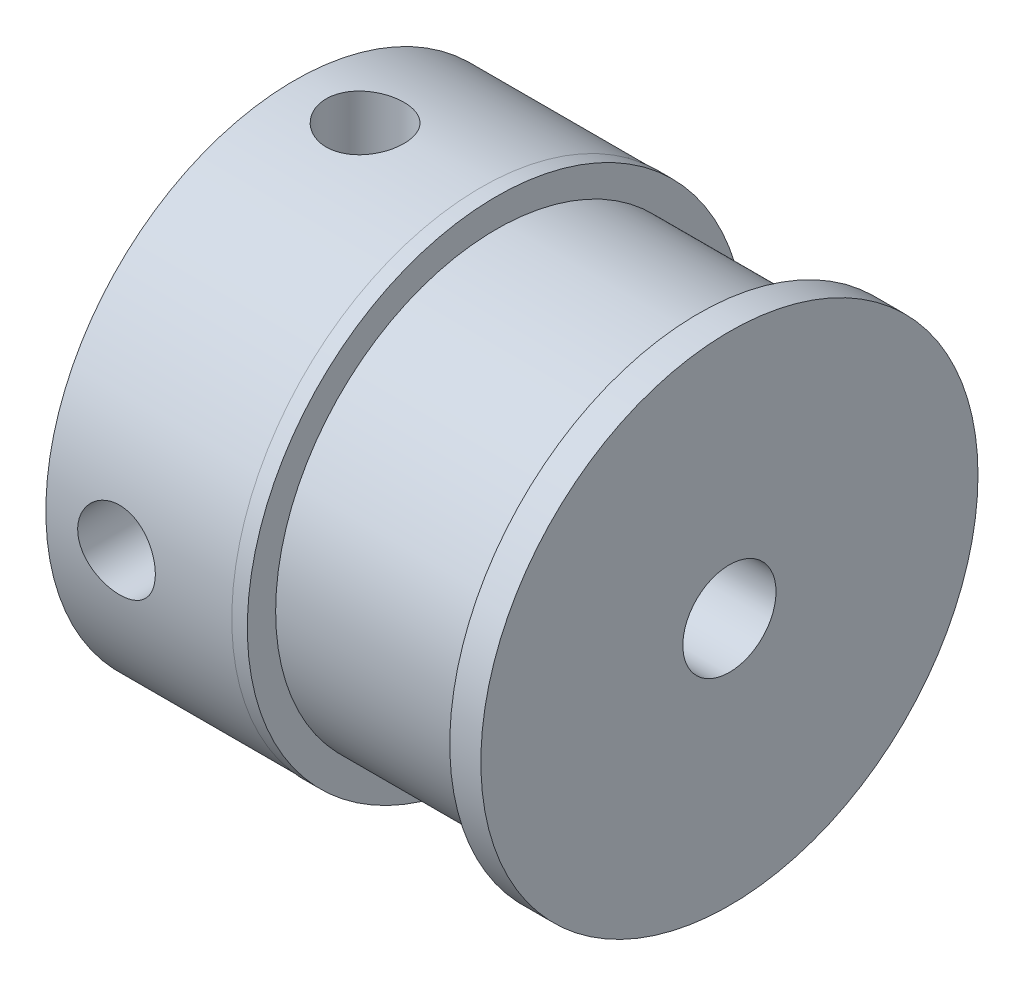
ISO-10303-21;
HEADER;
FILE_DESCRIPTION(('STEP AP214'),'2;1');
FILE_NAME('part.step','',(''),(''),'','','');
FILE_SCHEMA(('AUTOMOTIVE_DESIGN { 1 0 10303 214 1 1 1 1 }'));
ENDSEC;
DATA;
#1=APPLICATION_CONTEXT('core data for automotive mechanical design processes');
#2=APPLICATION_PROTOCOL_DEFINITION('international standard','automotive_design',2000,#1);
#3=PRODUCT_CONTEXT('',#1,'mechanical');
#4=PRODUCT('Part','Part','',(#3));
#5=PRODUCT_RELATED_PRODUCT_CATEGORY('part','',(#4));
#6=PRODUCT_DEFINITION_FORMATION('','',#4);
#7=PRODUCT_DEFINITION_CONTEXT('part definition',#1,'design');
#8=PRODUCT_DEFINITION('design','',#6,#7);
#9=PRODUCT_DEFINITION_SHAPE('','',#8);
#10=(LENGTH_UNIT() NAMED_UNIT(*) SI_UNIT(.MILLI.,.METRE.));
#11=(NAMED_UNIT(*) PLANE_ANGLE_UNIT() SI_UNIT($,.RADIAN.));
#12=(NAMED_UNIT(*) SI_UNIT($,.STERADIAN.) SOLID_ANGLE_UNIT());
#13=UNCERTAINTY_MEASURE_WITH_UNIT(LENGTH_MEASURE(1.E-05),#10,'distance_accuracy_value','');
#14=(GEOMETRIC_REPRESENTATION_CONTEXT(3) GLOBAL_UNCERTAINTY_ASSIGNED_CONTEXT((#13)) GLOBAL_UNIT_ASSIGNED_CONTEXT((#10,
#11,#12)) REPRESENTATION_CONTEXT('',''));
#15=CARTESIAN_POINT('',(0.,0.,0.));
#16=DIRECTION('',(0.,0.,1.));
#17=DIRECTION('',(1.,0.,0.));
#18=AXIS2_PLACEMENT_3D('',#15,#16,#17);
#19=CARTESIAN_POINT('',(0.,0.,0.));
#20=DIRECTION('',(1.,0.,0.));
#21=DIRECTION('',(0.,0.,-1.));
#22=AXIS2_PLACEMENT_3D('',#19,#20,#21);
#23=CYLINDRICAL_SURFACE('',#22,1.5);
#24=CARTESIAN_POINT('',(2.47573676781618,0.,1.5));
#25=CARTESIAN_POINT('',(2.47573921619604,0.0593787688504966,1.49999760600508));
#26=CARTESIAN_POINT('',(2.47999803172985,0.118775657075963,1.49644333306023));
#27=CARTESIAN_POINT('',(2.49671811752186,0.235591229710262,1.48255383426959));
#28=CARTESIAN_POINT('',(2.50918546251646,0.293008415894372,1.47221358646978));
#29=CARTESIAN_POINT('',(2.5413928685197,0.40391503473732,1.44571337985919));
#30=CARTESIAN_POINT('',(2.56108946081523,0.457425697494255,1.42958821794708));
#31=CARTESIAN_POINT('',(2.60674513591258,0.559920458095058,1.39264614580736));
#32=CARTESIAN_POINT('',(2.6327063346134,0.608903018804497,1.37182765054183));
#33=CARTESIAN_POINT('',(2.70046443786756,0.718951202770198,1.31836960624056));
#34=CARTESIAN_POINT('',(2.74457534321904,0.777846384687487,1.28419684309182));
#35=CARTESIAN_POINT('',(2.8409954475919,0.886006690341643,1.21211904371339));
#36=CARTESIAN_POINT('',(2.89332740004157,0.935244207719102,1.17420376089562));
#37=CARTESIAN_POINT('',(3.00626110126443,1.02476981505215,1.0969954782186));
#38=CARTESIAN_POINT('',(3.06699797882078,1.06487540714461,1.05768996729307));
#39=CARTESIAN_POINT('',(3.19608744006298,1.13460946975338,0.98247337823787));
#40=CARTESIAN_POINT('',(3.26441686856734,1.16426870455502,0.946552565043537));
#41=CARTESIAN_POINT('',(3.3765844459928,1.20096809386343,0.898966702929844));
#42=CARTESIAN_POINT('',(3.41750261645691,1.21216917699589,0.883683453779627));
#43=CARTESIAN_POINT('',(3.50167785923512,1.23050643018312,0.857964009892283));
#44=CARTESIAN_POINT('',(3.54492897179929,1.23765246650146,0.847516062002461));
#45=CARTESIAN_POINT('',(3.63362057458242,1.24740539483338,0.833105139761369));
#46=CARTESIAN_POINT('',(3.67908129864767,1.24995600781897,0.829222605301815));
#47=CARTESIAN_POINT('',(3.77001752301419,1.25004286433053,0.82909149017212));
#48=CARTESIAN_POINT('',(3.81549302350133,1.24757904212978,0.832843009565355));
#49=CARTESIAN_POINT('',(3.90850031765515,1.23752620102326,0.847707888605672));
#50=CARTESIAN_POINT('',(3.95588797041378,1.22952745139609,0.859408312456998));
#51=CARTESIAN_POINT('',(4.04783791365568,1.20871318849992,0.888442533165837));
#52=CARTESIAN_POINT('',(4.09239024869285,1.19588169148342,0.905794997455984));
#53=CARTESIAN_POINT('',(4.20384116551146,1.15722563130128,0.955139134708275));
#54=CARTESIAN_POINT('',(4.26845164802215,1.1281992385967,0.989734541742279));
#55=CARTESIAN_POINT('',(4.39076550682783,1.06071724104506,1.06176362696162));
#56=CARTESIAN_POINT('',(4.44845626185689,1.02224478491078,1.09920229401551));
#57=CARTESIAN_POINT('',(4.55985718059946,0.933838554257819,1.17538495988873));
#58=CARTESIAN_POINT('',(4.61320246420447,0.883411408236013,1.21409510992801));
#59=CARTESIAN_POINT('',(4.71129639825509,0.772419565040676,1.28754911495833));
#60=CARTESIAN_POINT('',(4.75606358998457,0.71187727442857,1.32230145708776));
#61=CARTESIAN_POINT('',(4.82544357864728,0.597056314168977,1.3771438938296));
#62=CARTESIAN_POINT('',(4.8523080537592,0.544863772530682,1.3987415689319));
#63=CARTESIAN_POINT('',(4.89890830349258,0.435535617240904,1.43653920142359));
#64=CARTESIAN_POINT('',(4.91864852764064,0.378403116632034,1.45274252741889));
#65=CARTESIAN_POINT('',(4.94994534841406,0.259977180591753,1.4785491218404));
#66=CARTESIAN_POINT('',(4.9614387285308,0.198655468325018,1.48810139016471));
#67=CARTESIAN_POINT('',(4.97509139638547,0.074279981703984,1.4994571872496));
#68=CARTESIAN_POINT('',(4.97725692933837,0.0112273946835217,1.50126590049908));
#69=CARTESIAN_POINT('',(4.97240554272749,-0.106655102299901,1.49722498729296));
#70=CARTESIAN_POINT('',(4.96645743804378,-0.16156528532416,1.49226673517921));
#71=CARTESIAN_POINT('',(4.94760330312647,-0.269322467292319,1.47662796570524));
#72=CARTESIAN_POINT('',(4.93469643825529,-0.322169217931431,1.46594676193199));
#73=CARTESIAN_POINT('',(4.90242503330327,-0.425282807428053,1.43944754113185));
#74=CARTESIAN_POINT('',(4.88297623566383,-0.475505558665491,1.42356257517913));
#75=CARTESIAN_POINT('',(4.83853908912888,-0.57182928685619,1.38768087304245));
#76=CARTESIAN_POINT('',(4.81354869253305,-0.617928731328815,1.36768261713727));
#77=CARTESIAN_POINT('',(4.74652012635126,-0.725338376691834,1.31487441147003));
#78=CARTESIAN_POINT('',(4.70186712143983,-0.784177111169767,1.28034513521539));
#79=CARTESIAN_POINT('',(4.6043199417885,-0.892139643516488,1.20761833212685));
#80=CARTESIAN_POINT('',(4.5514002740406,-0.941232285418771,1.16940960315471));
#81=CARTESIAN_POINT('',(4.43724881534649,-1.03033901299863,1.09176431315107));
#82=CARTESIAN_POINT('',(4.3758845371821,-1.07017375330096,1.05231803111602));
#83=CARTESIAN_POINT('',(4.24544418766809,-1.13922410535013,0.977105860325163));
#84=CARTESIAN_POINT('',(4.17639432509731,-1.1684744432838,0.941328217251961));
#85=CARTESIAN_POINT('',(4.06358778311069,-1.20418713962594,0.894635188877057));
#86=CARTESIAN_POINT('',(4.02281582938486,-1.21494166451886,0.87985553504527));
#87=CARTESIAN_POINT('',(3.93901449440423,-1.23241118575506,0.855213348293519));
#88=CARTESIAN_POINT('',(3.89599104654498,-1.23913627036995,0.845338546087732));
#89=CARTESIAN_POINT('',(3.80791688748515,-1.24808646608226,0.83207709579727));
#90=CARTESIAN_POINT('',(3.76284856086769,-1.25025897513146,0.828766313990411));
#91=CARTESIAN_POINT('',(3.6728107036402,-1.24969100631609,0.829621484389423));
#92=CARTESIAN_POINT('',(3.62784120221098,-1.24694923297195,0.833789408096123));
#93=CARTESIAN_POINT('',(3.53489927185018,-1.23632620681834,0.849464182651597));
#94=CARTESIAN_POINT('',(3.4871172059412,-1.2279286145655,0.861705472805855));
#95=CARTESIAN_POINT('',(3.39447556110775,-1.20625214805455,0.891795027098452));
#96=CARTESIAN_POINT('',(3.34962623201771,-1.19295712996402,0.909661806430648));
#97=CARTESIAN_POINT('',(3.23739496966614,-1.15299054037419,0.960293381079604));
#98=CARTESIAN_POINT('',(3.17235543878304,-1.12305667484071,0.995623570298286));
#99=CARTESIAN_POINT('',(3.04932713191973,-1.05354944095062,1.06893108151573));
#100=CARTESIAN_POINT('',(2.99135102952955,-1.01395911755888,1.10691297478661));
#101=CARTESIAN_POINT('',(2.8797460144365,-0.923157683511299,1.18384825527249));
#102=CARTESIAN_POINT('',(2.82646928331439,-0.871472234833846,1.22275805975962));
#103=CARTESIAN_POINT('',(2.72880146319055,-0.75776534327967,1.29628639574612));
#104=CARTESIAN_POINT('',(2.68439070026799,-0.695767358080637,1.33091436227145));
#105=CARTESIAN_POINT('',(2.61658025090925,-0.579278005881,1.38471086227029));
#106=CARTESIAN_POINT('',(2.5907176675039,-0.526999500141208,1.40556069252782));
#107=CARTESIAN_POINT('',(2.54612727810661,-0.417719782772079,1.44180748060129));
#108=CARTESIAN_POINT('',(2.52738996772036,-0.360724986716828,1.45721170036657));
#109=CARTESIAN_POINT('',(2.50064257147279,-0.253310041564166,1.47929369322444));
#110=CARTESIAN_POINT('',(2.49134921580257,-0.20342273942501,1.48701070119817));
#111=CARTESIAN_POINT('',(2.4788955745983,-0.102361357783516,1.49736462476332));
#112=CARTESIAN_POINT('',(2.47573465719265,-0.0511874114043477,1.50000206374105));
#113=CARTESIAN_POINT('',(2.47573676781618,0.,1.5));
#114=B_SPLINE_CURVE_WITH_KNOTS('',3,(#24,#25,#26,#27,#28,#29,#30,#31,#32,#33,#34,#35,#36,#37,
#38,#39,#40,#41,#42,#43,#44,#45,#46,#47,#48,#49,#50,#51,#52,#53,#54,#55,#56,#57,#58,#59,#60,#61,
#62,#63,#64,#65,#66,#67,#68,#69,#70,#71,#72,#73,#74,#75,#76,#77,#78,#79,#80,#81,#82,#83,#84,#85,
#86,#87,#88,#89,#90,#91,#92,#93,#94,#95,#96,#97,#98,#99,#100,#101,#102,#103,#104,#105,#106,#107,
#108,#109,#110,#111,#112,#113),.UNSPECIFIED.,.T.,.F.,(4,2,2,2,2,2,2,2,2,2,2,2,2,2,2,2,2,2,2,2,2,
2,2,2,2,2,2,2,2,2,2,2,2,2,2,2,2,2,2,2,2,2,2,2,4),(0.,0.177920638407556,0.355973095513479,
0.532972026797752,0.710030824150575,0.952125893800628,1.19490321558387,1.4421737640865,
1.68870989486939,1.82361318167479,1.95818681458037,2.0943976161209,2.23061020305626,
2.37816635242836,2.52621487430063,2.76143398970636,2.9970758121581,3.24501566810456,
3.49241341014754,3.67933989515108,3.86614943036557,4.0543760919618,4.24247671173499,
4.40804641875282,4.57363598871254,4.74144560410122,4.90931733118535,5.15261089108599,
5.39667010414655,5.64512295341126,5.89275310452977,6.02641745468303,6.15974574356461,
6.29460624678872,6.42950230652134,6.57876724728638,6.72852869227186,6.96677041328346,
7.20543349464894,7.45579032127004,7.70558526561254,7.89070171070695,8.07557035570184,
8.22896247938915,8.38233879708313),.UNSPECIFIED.);
#115=CARTESIAN_POINT('',(4.38717459558231,1.06066017177982,1.06066017177982));
#116=VERTEX_POINT('',#115);
#117=CARTESIAN_POINT('',(3.06429894005004,1.06066017177982,1.06066017177983));
#118=VERTEX_POINT('',#117);
#119=EDGE_CURVE('E54',#116,#118,#114,.T.);
#120=ORIENTED_EDGE('',*,*,#119,.F.);
#121=CARTESIAN_POINT('',(3.72573676781618,0.829156197588858,-1.25));
#122=CARTESIAN_POINT('',(3.76990147319638,0.829171080733855,-1.24999404087226));
#123=CARTESIAN_POINT('',(3.81412028903637,0.832762375395273,-1.24763049967423));
#124=CARTESIAN_POINT('',(3.90112206906255,0.846396290427039,-1.23841578381773));
#125=CARTESIAN_POINT('',(3.94389956627191,0.85646107703313,-1.23154918841669));
#126=CARTESIAN_POINT('',(4.04329220081502,0.886166295980824,-1.21043365494066));
#127=CARTESIAN_POINT('',(4.09883884783212,0.908006666466343,-1.19435434755409));
#128=CARTESIAN_POINT('',(4.20531940293517,0.956683967866326,-1.15573690008527));
#129=CARTESIAN_POINT('',(4.25623767236724,0.983536965992075,-1.13317786130271));
#130=CARTESIAN_POINT('',(4.37549514289653,1.05182143936408,-1.070817065168));
#131=CARTESIAN_POINT('',(4.4414966219207,1.09442045045526,-1.02781025867357));
#132=CARTESIAN_POINT('',(4.56465186710163,1.17868626480119,-0.929991014491961));
#133=CARTESIAN_POINT('',(4.62181382422735,1.2203539000892,-0.875189620049184));
#134=CARTESIAN_POINT('',(4.71502688442383,1.29053257092504,-0.766663658737558));
#135=CARTESIAN_POINT('',(4.7529840470123,1.31995958434628,-0.715176307152019));
#136=CARTESIAN_POINT('',(4.82140712561471,1.37388140866488,-0.60513454605341));
#137=CARTESIAN_POINT('',(4.85188517519341,1.3983841964128,-0.546591815897449));
#138=CARTESIAN_POINT('',(4.89929283092417,1.43686412264529,-0.433965688541277));
#139=CARTESIAN_POINT('',(4.91765365159946,1.45192852122773,-0.380860387543681));
#140=CARTESIAN_POINT('',(4.94722707114738,1.47630204543213,-0.271416974505907));
#141=CARTESIAN_POINT('',(4.95844378960588,1.48561448777698,-0.215080746020962));
#142=CARTESIAN_POINT('',(4.97303749070007,1.49774576733632,-0.100453129804018));
#143=CARTESIAN_POINT('',(4.97638168203589,1.5005374433429,-0.0421545865612094));
#144=CARTESIAN_POINT('',(4.97488564591255,1.49929071908751,0.0742637120693309));
#145=CARTESIAN_POINT('',(4.97004559976376,1.49525247013301,0.132383471389195));
#146=CARTESIAN_POINT('',(4.95312966386739,1.48120670588946,0.242722987690765));
#147=CARTESIAN_POINT('',(4.94156128995952,1.47161807443048,0.295076907899648));
#148=CARTESIAN_POINT('',(4.91226277112176,1.44750645993,0.396813223309239));
#149=CARTESIAN_POINT('',(4.89453174228222,1.43298276905959,0.446195191050169));
#150=CARTESIAN_POINT('',(4.85194151156906,1.39845194139805,0.545266441516652));
#151=CARTESIAN_POINT('',(4.82660216199074,1.3780819168441,0.59462039448926));
#152=CARTESIAN_POINT('',(4.77053714143614,1.33372220395884,0.688391071359202));
#153=CARTESIAN_POINT('',(4.73980662922847,1.30972926499255,0.732803298534896));
#154=CARTESIAN_POINT('',(4.65801417630143,1.24725283392923,0.836393722531952));
#155=CARTESIAN_POINT('',(4.60423337742237,1.20730441725272,0.892549793915363));
#156=CARTESIAN_POINT('',(4.48806119896528,1.12556797145891,0.993638529177491));
#157=CARTESIAN_POINT('',(4.42565477821127,1.08377681764698,1.03855119382815));
#158=CARTESIAN_POINT('',(4.31015606132209,1.01367839645618,1.10642031272616));
#159=CARTESIAN_POINT('',(4.25899931264068,0.984740465846717,1.13203948271785));
#160=CARTESIAN_POINT('',(4.15181182127987,0.931069709507051,1.17656863192196));
#161=CARTESIAN_POINT('',(4.09579548295912,0.906325057687525,1.19549764866108));
#162=CARTESIAN_POINT('',(3.99782570359674,0.871882971831384,1.2207056855963));
#163=CARTESIAN_POINT('',(3.95723714994486,0.859909724231183,1.22909685175358));
#164=CARTESIAN_POINT('',(3.87425643713497,0.841388366026603,1.24185130532595));
#165=CARTESIAN_POINT('',(3.83186876684092,0.834827501853275,1.24622406437787));
#166=CARTESIAN_POINT('',(3.74602278010273,0.828296528501309,1.25057759306023));
#167=CARTESIAN_POINT('',(3.70255896648102,0.828374008685679,1.25052664975154));
#168=CARTESIAN_POINT('',(3.6163842184697,0.835225782947466,1.24595802348496));
#169=CARTESIAN_POINT('',(3.57367440990335,0.842009349756126,1.2414341556627));
#170=CARTESIAN_POINT('',(3.47964323210418,0.863399128259976,1.22668003680201));
#171=CARTESIAN_POINT('',(3.42886885742171,0.879547518492406,1.21529777259545));
#172=CARTESIAN_POINT('',(3.33092598881999,0.917232747019947,1.18711365735934));
#173=CARTESIAN_POINT('',(3.28377005775815,0.938787339391932,1.17029389583342));
#174=CARTESIAN_POINT('',(3.16712613750772,0.997868621064618,1.12091579801675));
#175=CARTESIAN_POINT('',(3.10020129736553,1.03750412177146,1.0848481038527));
#176=CARTESIAN_POINT('',(2.97431048414528,1.11795958286267,1.0017702868871));
#177=CARTESIAN_POINT('',(2.91535623866963,1.15878118348297,0.954744311539842));
#178=CARTESIAN_POINT('',(2.80449730740394,1.23882330951385,0.848446129663126));
#179=CARTESIAN_POINT('',(2.7528099913423,1.27797673016274,0.788892937369288));
#180=CARTESIAN_POINT('',(2.6603075166079,1.34974000513073,0.658554811895184));
#181=CARTESIAN_POINT('',(2.61945597465658,1.38237166417956,0.587808772156693));
#182=CARTESIAN_POINT('',(2.56276503211143,1.42822592109973,0.461595088972356));
#183=CARTESIAN_POINT('',(2.54312485647277,1.44429507033465,0.40885943902425));
#184=CARTESIAN_POINT('',(2.51092214027294,1.47077851557489,0.299904276444405));
#185=CARTESIAN_POINT('',(2.49835409045303,1.4811972131105,0.24368751364011));
#186=CARTESIAN_POINT('',(2.48104724704493,1.49556964902824,0.128950522663651));
#187=CARTESIAN_POINT('',(2.47634615192641,1.49949225720631,0.0704205711750116));
#188=CARTESIAN_POINT('',(2.4752392103812,1.5004145545401,-0.0467748285323739));
#189=CARTESIAN_POINT('',(2.47883275813911,1.49741474928776,-0.105440266542963));
#190=CARTESIAN_POINT('',(2.4934842092044,1.48523794227419,-0.216739569352161));
#191=CARTESIAN_POINT('',(2.50397969175486,1.47652651443398,-0.269501624532633));
#192=CARTESIAN_POINT('',(2.53125878840237,1.454035179736,-0.372221179705353));
#193=CARTESIAN_POINT('',(2.54804338583675,1.44025448027619,-0.422178239716078));
#194=CARTESIAN_POINT('',(2.58854502831531,1.40732209423503,-0.521919916074492));
#195=CARTESIAN_POINT('',(2.61267644796603,1.38785344874152,-0.571429449732368));
#196=CARTESIAN_POINT('',(2.66634044109119,1.34519757223151,-0.665676902134284));
#197=CARTESIAN_POINT('',(2.69587717892475,1.32200747584648,-0.710411099504568));
#198=CARTESIAN_POINT('',(2.7747519806095,1.26133215586173,-0.815004958790827));
#199=CARTESIAN_POINT('',(2.82681958582168,1.22230011385721,-0.871916856439117));
#200=CARTESIAN_POINT('',(2.93950192965901,1.14196239842367,-0.97477282015326));
#201=CARTESIAN_POINT('',(3.00013450247039,1.10065209341852,-1.02069344825837));
#202=CARTESIAN_POINT('',(3.11550510654346,1.02874460749124,-1.09255581437419));
#203=CARTESIAN_POINT('',(3.16866418076646,0.997768980763185,-1.12067062123729));
#204=CARTESIAN_POINT('',(3.28035838856266,0.939989503311802,-1.16954598910695));
#205=CARTESIAN_POINT('',(3.33887832197681,0.91317440458917,-1.1903265794276));
#206=CARTESIAN_POINT('',(3.44067552435427,0.875984709267766,-1.21778307121979));
#207=CARTESIAN_POINT('',(3.48237639175947,0.863119730558277,-1.22685233579967));
#208=CARTESIAN_POINT('',(3.56774798496368,0.843069286999142,-1.24072116574167));
#209=CARTESIAN_POINT('',(3.6114104439255,0.835861989029712,-1.24553715368945));
#210=CARTESIAN_POINT('',(3.67880683372215,0.830150605780703,-1.2493403884987));
#211=CARTESIAN_POINT('',(3.70226415848302,0.829148287511226,-1.25000316715069));
#212=CARTESIAN_POINT('',(3.72573676781618,0.829156197588858,-1.25));
#213=B_SPLINE_CURVE_WITH_KNOTS('',3,(#121,#122,#123,#124,#125,#126,#127,#128,#129,#130,#131,
#132,#133,#134,#135,#136,#137,#138,#139,#140,#141,#142,#143,#144,#145,#146,#147,#148,#149,#150,
#151,#152,#153,#154,#155,#156,#157,#158,#159,#160,#161,#162,#163,#164,#165,#166,#167,#168,#169,
#170,#171,#172,#173,#174,#175,#176,#177,#178,#179,#180,#181,#182,#183,#184,#185,#186,#187,#188,
#189,#190,#191,#192,#193,#194,#195,#196,#197,#198,#199,#200,#201,#202,#203,#204,#205,#206,#207,
#208,#209,#210,#211,#212),.UNSPECIFIED.,.T.,.F.,(4,2,2,2,2,2,2,2,2,2,2,2,2,2,2,2,2,2,2,2,2,2,2,
2,2,2,2,2,2,2,2,2,2,2,2,2,2,2,2,2,2,2,2,2,2,4),(0.,0.132403743422233,0.265263288930075,
0.449655855557676,0.634649942144409,0.90201244102649,1.16912568969086,1.37958069530741,
1.58969198279197,1.76348814983066,1.93718400783419,2.11160208780425,2.2860163038354,
2.44872292747117,2.61145289775614,2.7881084872776,2.96492353213236,3.22582525437774,
3.48718781023124,3.67905555270854,3.87037283441413,3.9993530692101,4.12802850386463,
4.25762647137534,4.38740388935218,4.54993403686821,4.71300509008803,4.96887834533348,
5.22512407721335,5.48788549042256,5.74975312897907,5.9246269566114,6.09936436646698,
6.27493674560801,6.45049630188436,6.61327577206191,6.77608070432303,6.95068885647625,
7.1254321007351,7.38342809840436,7.64196944496193,7.84437004385549,8.04621354192261,
8.17947958193174,8.31222878184587,8.38259857865176),.UNSPECIFIED.);
#214=EDGE_CURVE('E61',#118,#116,#213,.T.);
#215=ORIENTED_EDGE('',*,*,#214,.F.);
#216=EDGE_LOOP('',(#120,#215));
#217=FACE_BOUND('',#216,.T.);
#218=CARTESIAN_POINT('',(15.4514735356324,0.,0.));
#219=DIRECTION('',(1.,0.,0.));
#220=DIRECTION('',(0.,0.,-1.));
#221=AXIS2_PLACEMENT_3D('',#218,#219,#220);
#222=CIRCLE('',#221,1.5);
#223=CARTESIAN_POINT('',(15.4514735356324,0.,-1.5));
#224=VERTEX_POINT('',#223);
#225=EDGE_CURVE('E71',#224,#224,#222,.T.);
#226=ORIENTED_EDGE('',*,*,#225,.T.);
#227=EDGE_LOOP('',(#226));
#228=FACE_BOUND('',#227,.T.);
#229=CARTESIAN_POINT('',(1.45147353563235,0.,0.));
#230=DIRECTION('',(1.,0.,0.));
#231=DIRECTION('',(0.,0.,-1.));
#232=AXIS2_PLACEMENT_3D('',#229,#230,#231);
#233=CIRCLE('',#232,1.5);
#234=CARTESIAN_POINT('',(1.45147353563235,0.,-1.5));
#235=VERTEX_POINT('',#234);
#236=EDGE_CURVE('E48',#235,#235,#233,.T.);
#237=ORIENTED_EDGE('',*,*,#236,.F.);
#238=EDGE_LOOP('',(#237));
#239=FACE_BOUND('',#238,.T.);
#240=ADVANCED_FACE('F39',(#217,#228,#239),#23,.F.);
#241=CARTESIAN_POINT('',(1.45147353563235,1.5,0.));
#242=DIRECTION('',(-1.,0.,0.));
#243=DIRECTION('',(0.,0.,1.));
#244=AXIS2_PLACEMENT_3D('',#241,#242,#243);
#245=PLANE('',#244);
#246=ORIENTED_EDGE('',*,*,#236,.T.);
#247=EDGE_LOOP('',(#246));
#248=FACE_BOUND('',#247,.T.);
#249=CARTESIAN_POINT('',(1.45147353563235,0.,0.));
#250=DIRECTION('',(1.,0.,0.));
#251=DIRECTION('',(0.,0.,-1.));
#252=AXIS2_PLACEMENT_3D('',#249,#250,#251);
#253=CIRCLE('',#252,8.);
#254=CARTESIAN_POINT('',(1.45147353563235,0.,-8.));
#255=VERTEX_POINT('',#254);
#256=EDGE_CURVE('E118',#255,#255,#253,.T.);
#257=ORIENTED_EDGE('',*,*,#256,.F.);
#258=EDGE_LOOP('',(#257));
#259=FACE_BOUND('',#258,.T.);
#260=ADVANCED_FACE('F104',(#248,#259),#245,.T.);
#261=CARTESIAN_POINT('',(0.,0.,0.));
#262=DIRECTION('',(1.,0.,0.));
#263=DIRECTION('',(0.,0.,-1.));
#264=AXIS2_PLACEMENT_3D('',#261,#262,#263);
#265=CYLINDRICAL_SURFACE('',#264,8.);
#266=CARTESIAN_POINT('',(2.47573676781618,0.,8.));
#267=CARTESIAN_POINT('',(2.47573961695194,-0.069757548635516,7.99999885097242));
#268=CARTESIAN_POINT('',(2.48159582470296,-0.139554702432851,7.9990780624287));
#269=CARTESIAN_POINT('',(2.50485861345456,-0.277195657489049,7.99549349048797));
#270=CARTESIAN_POINT('',(2.52227621406794,-0.345037530661656,7.99282804422361));
#271=CARTESIAN_POINT('',(2.56812659921949,-0.476756269023699,7.98605348582888));
#272=CARTESIAN_POINT('',(2.59655080849698,-0.540636176144948,7.98194549781586));
#273=CARTESIAN_POINT('',(2.66358604038699,-0.662710625522295,7.97273897019078));
#274=CARTESIAN_POINT('',(2.70219573933415,-0.720905905184149,7.96764055931277));
#275=CARTESIAN_POINT('',(2.78885329199316,-0.830459955825804,7.95697134207178));
#276=CARTESIAN_POINT('',(2.83697026526131,-0.881763739571317,7.95139725696169));
#277=CARTESIAN_POINT('',(2.94112774195063,-0.97560384411411,7.94043038065144));
#278=CARTESIAN_POINT('',(2.99716871646628,-1.01813964327095,7.93503760025375));
#279=CARTESIAN_POINT('',(3.11595590348804,-1.09345272164441,7.92501214063723));
#280=CARTESIAN_POINT('',(3.17873650899708,-1.12617636778995,7.92038369893053));
#281=CARTESIAN_POINT('',(3.30898747324508,-1.18059340798532,7.91245600871183));
#282=CARTESIAN_POINT('',(3.37645755407146,-1.20228745505031,7.90915668151108));
#283=CARTESIAN_POINT('',(3.51359221838807,-1.23385779661083,7.90429317255519));
#284=CARTESIAN_POINT('',(3.58323456072558,-1.24382852743747,7.90271513266182));
#285=CARTESIAN_POINT('',(3.7232203622625,-1.2519618487881,7.90143085535887));
#286=CARTESIAN_POINT('',(3.7935637775492,-1.25012517430232,7.90172450144012));
#287=CARTESIAN_POINT('',(3.93228528374252,-1.23477290404444,7.90413775227604));
#288=CARTESIAN_POINT('',(4.00067537949275,-1.22136281479846,7.90624086092473));
#289=CARTESIAN_POINT('',(4.13422277099584,-1.18340968916875,7.91201028172737));
#290=CARTESIAN_POINT('',(4.19937996813644,-1.15886631342065,7.91567664153207));
#291=CARTESIAN_POINT('',(4.32493112415475,-1.09923458474691,7.92417753427311));
#292=CARTESIAN_POINT('',(4.38530366370271,-1.06410186157774,7.92901696543623));
#293=CARTESIAN_POINT('',(4.49933653565894,-0.984320290733179,7.9393152307505));
#294=CARTESIAN_POINT('',(4.55299639025991,-0.939670766265077,7.94477410894106));
#295=CARTESIAN_POINT('',(4.65269189113283,-0.841545444111659,7.95576893124449));
#296=CARTESIAN_POINT('',(4.6986383469509,-0.78797900280269,7.96130506817796));
#297=CARTESIAN_POINT('',(4.78090334063612,-0.673848473689676,7.97177562673913));
#298=CARTESIAN_POINT('',(4.81722182959458,-0.613284350340655,7.97671004531012));
#299=CARTESIAN_POINT('',(4.87920580452737,-0.486797963528243,7.98542699513519));
#300=CARTESIAN_POINT('',(4.90486404708267,-0.420872093120228,7.98920874270967));
#301=CARTESIAN_POINT('',(4.94471975153978,-0.285574767348378,7.99518780000339));
#302=CARTESIAN_POINT('',(4.95891805484941,-0.216203565343599,7.99738522604489));
#303=CARTESIAN_POINT('',(4.97533140604126,-0.0767541683818674,7.99993255863639));
#304=CARTESIAN_POINT('',(4.97766900730426,-0.00669073075435115,8.00030135896431));
#305=CARTESIAN_POINT('',(4.97062041514818,0.13282727320582,7.99920143245635));
#306=CARTESIAN_POINT('',(4.96123461652161,0.202281859962576,7.99773276749822));
#307=CARTESIAN_POINT('',(4.93110757397608,0.33823672313285,7.99313461846611));
#308=CARTESIAN_POINT('',(4.9104263886823,0.404750631028018,7.99001392107693));
#309=CARTESIAN_POINT('',(4.85835922061677,0.53336703392831,7.9824603784178));
#310=CARTESIAN_POINT('',(4.82697269859483,0.5954693065197,7.97802746705036));
#311=CARTESIAN_POINT('',(4.75410077225288,0.714036101125199,7.96829486370472));
#312=CARTESIAN_POINT('',(4.71253805777093,0.770452561891857,7.96298864331711));
#313=CARTESIAN_POINT('',(4.62060072486228,0.875553482539024,7.95211940232218));
#314=CARTESIAN_POINT('',(4.57022554821375,0.924237452235083,7.94655636546338));
#315=CARTESIAN_POINT('',(4.46154616920757,1.01294040388345,7.93574013768325));
#316=CARTESIAN_POINT('',(4.40317434425501,1.05287699292062,7.93049020595402));
#317=CARTESIAN_POINT('',(4.28047873098551,1.12237783863319,7.92095346402914));
#318=CARTESIAN_POINT('',(4.21615511407144,1.15194239389052,7.91666662610999));
#319=CARTESIAN_POINT('',(4.08362194745908,1.19973385972497,7.90956535676179));
#320=CARTESIAN_POINT('',(4.01542803343336,1.21800327473955,7.9067454117448));
#321=CARTESIAN_POINT('',(3.87689219598419,1.24282061020267,7.90288285140397));
#322=CARTESIAN_POINT('',(3.80655043510667,1.24936941542498,7.9018401019222));
#323=CARTESIAN_POINT('',(3.66653740986244,1.25053726345377,7.90165529022443));
#324=CARTESIAN_POINT('',(3.59686721934943,1.24528590274212,7.90249258021451));
#325=CARTESIAN_POINT('',(3.45941411924403,1.2232811162795,7.90592849470915));
#326=CARTESIAN_POINT('',(3.39163120556532,1.2065277154348,7.90852711539976));
#327=CARTESIAN_POINT('',(3.25991785449592,1.16204164945925,7.91518544427453));
#328=CARTESIAN_POINT('',(3.19598402868697,1.1343188086929,7.91924384476705));
#329=CARTESIAN_POINT('',(3.07365396097804,1.06869384273208,7.92836592023698));
#330=CARTESIAN_POINT('',(3.01525793867196,1.03079131410442,7.93342963505414));
#331=CARTESIAN_POINT('',(2.90500399575277,0.945415040695392,7.94405784046131));
#332=CARTESIAN_POINT('',(2.85322066950926,0.897845535473836,7.94962700580145));
#333=CARTESIAN_POINT('',(2.75832614962281,0.794687973191015,7.96060021820367));
#334=CARTESIAN_POINT('',(2.71521696852024,0.739098060392157,7.96600422670062));
#335=CARTESIAN_POINT('',(2.6386611563004,0.621083429421703,7.9760755122835));
#336=CARTESIAN_POINT('',(2.60527408143638,0.558619686071187,7.98073817215134));
#337=CARTESIAN_POINT('',(2.54951626971971,0.428925941178889,7.98875629919441));
#338=CARTESIAN_POINT('',(2.52713428153699,0.361700888290879,7.9921131007106));
#339=CARTESIAN_POINT('',(2.49902025727089,0.245157119955796,7.99638722932441));
#340=CARTESIAN_POINT('',(2.49030252250168,0.196552787825811,7.99773495813061));
#341=CARTESIAN_POINT('',(2.47865981112665,0.0986388989252907,7.99954174348811));
#342=CARTESIAN_POINT('',(2.47573475303752,0.0493293520845591,8.00000081253983));
#343=CARTESIAN_POINT('',(2.47573676781618,0.,8.));
#344=B_SPLINE_CURVE_WITH_KNOTS('',3,(#266,#267,#268,#269,#270,#271,#272,#273,#274,#275,#276,
#277,#278,#279,#280,#281,#282,#283,#284,#285,#286,#287,#288,#289,#290,#291,#292,#293,#294,#295,
#296,#297,#298,#299,#300,#301,#302,#303,#304,#305,#306,#307,#308,#309,#310,#311,#312,#313,#314,
#315,#316,#317,#318,#319,#320,#321,#322,#323,#324,#325,#326,#327,#328,#329,#330,#331,#332,#333,
#334,#335,#336,#337,#338,#339,#340,#341,#342,#343),.UNSPECIFIED.,.T.,.F.,(4,2,2,2,2,2,2,2,2,2,2,
2,2,2,2,2,2,2,2,2,2,2,2,2,2,2,2,2,2,2,2,2,2,2,2,2,2,2,4),(0.,0.209092370238744,
0.418384321264004,0.62751353972051,0.836615593960145,1.04729784076099,1.2579926182271,
1.46981889302879,1.68163262504618,1.89172815567496,2.10181060835271,2.30999788011289,
2.51819149825524,2.72726988701172,2.93636314946032,3.14772866167181,3.35909524756911,
3.5706052187728,3.78209965914931,3.99140427002955,4.20070183264176,4.40889722378281,
4.61710310371013,4.82694270734832,5.03679560800705,5.24854740124792,5.46029309824487,
5.67123705197562,5.88216508114644,6.09078790799342,6.29941028309444,6.50784623483305,
6.7162904483567,6.92691006157766,7.13757848571145,7.34951152099917,7.56122742828135,
7.70909008175765,7.85695065529349),.UNSPECIFIED.);
#345=CARTESIAN_POINT('',(2.47573676781618,0.,8.));
#346=VERTEX_POINT('',#345);
#347=EDGE_CURVE('E63',#346,#346,#344,.T.);
#348=ORIENTED_EDGE('',*,*,#347,.F.);
#349=EDGE_LOOP('',(#348));
#350=FACE_BOUND('',#349,.T.);
#351=CARTESIAN_POINT('',(3.72573676781618,7.90174031463956,-1.25));
#352=CARTESIAN_POINT('',(3.65598507865258,7.90174151747695,-1.24999714589602));
#353=CARTESIAN_POINT('',(3.58619376899394,7.90267390208987,-1.24414188871431));
#354=CARTESIAN_POINT('',(3.4485649533336,7.90629985526833,-1.2208832182291));
#355=CARTESIAN_POINT('',(3.38072938008024,7.90899510762377,-1.20346876400912));
#356=CARTESIAN_POINT('',(3.24902397298733,7.91583424559869,-1.15762758023421));
#357=CARTESIAN_POINT('',(3.18515104387902,7.919976983357,-1.12920957460922));
#358=CARTESIAN_POINT('',(3.0630883223969,7.92924294913634,-1.06218895908233));
#359=CARTESIAN_POINT('',(3.00489780098689,7.93436605112925,-1.02358765802571));
#360=CARTESIAN_POINT('',(2.89533852524006,7.94506519257156,-0.936938650554445));
#361=CARTESIAN_POINT('',(2.84402623061623,7.95064443921898,-0.888819943087468));
#362=CARTESIAN_POINT('',(2.75016965760134,7.96159865413737,-0.784655404938385));
#363=CARTESIAN_POINT('',(2.70762587470407,7.96697361085028,-0.728609126584248));
#364=CARTESIAN_POINT('',(2.63230432929557,7.97694733576469,-0.609817145928797));
#365=CARTESIAN_POINT('',(2.59957876582894,7.98154190081689,-0.547037963178642));
#366=CARTESIAN_POINT('',(2.54515779045365,7.98940157455279,-0.416790085897379));
#367=CARTESIAN_POINT('',(2.52346174712485,7.99266675933898,-0.349321660068405));
#368=CARTESIAN_POINT('',(2.49188740833809,7.99747714289859,-0.212192662724404));
#369=CARTESIAN_POINT('',(2.481914443282,7.99903611302523,-0.142554380080375));
#370=CARTESIAN_POINT('',(2.47377524616449,8.00030565490477,-0.00257657177533519));
#371=CARTESIAN_POINT('',(2.47560830464026,8.00001633772735,0.0677629114945936));
#372=CARTESIAN_POINT('',(2.49095473095511,7.99763286949342,0.206500044861076));
#373=CARTESIAN_POINT('',(2.50436623723634,7.99555445847991,0.274909271287587));
#374=CARTESIAN_POINT('',(2.54232878212749,7.98984386977642,0.408494187671745));
#375=CARTESIAN_POINT('',(2.56688012699325,7.98621164936936,0.473669788676087));
#376=CARTESIAN_POINT('',(2.6265285957462,7.97777459210141,0.599243713396235));
#377=CARTESIAN_POINT('',(2.66166827053015,7.97296503885209,0.659621495359184));
#378=CARTESIAN_POINT('',(2.7414648081308,7.96270873510232,0.773661928266065));
#379=CARTESIAN_POINT('',(2.78612234979367,7.95726193916409,0.827324099796618));
#380=CARTESIAN_POINT('',(2.88425351135281,7.94626939127782,0.927010992600115));
#381=CARTESIAN_POINT('',(2.93781610101361,7.94072320355105,0.972948128065372));
#382=CARTESIAN_POINT('',(3.05193555015724,7.93021346922373,1.05519613023742));
#383=CARTESIAN_POINT('',(3.11249245995321,7.92524992681491,1.09150692769167));
#384=CARTESIAN_POINT('',(3.23897658186908,7.91646746408067,1.15348530317842));
#385=CARTESIAN_POINT('',(3.3049085553529,7.91264957292446,1.1791433194208));
#386=CARTESIAN_POINT('',(3.44021919216892,7.9066084495474,1.21899671563834));
#387=CARTESIAN_POINT('',(3.50959759035104,7.90438509485371,1.23319297597629));
#388=CARTESIAN_POINT('',(3.64905081945378,7.9018081848443,1.24959859618928));
#389=CARTESIAN_POINT('',(3.71911066791355,7.90143522402999,1.25193236705635));
#390=CARTESIAN_POINT('',(3.85862058546513,7.9025497488591,1.24487739516592));
#391=CARTESIAN_POINT('',(3.92807067506911,7.90403717167622,1.23548904827164));
#392=CARTESIAN_POINT('',(4.06400067154941,7.90868700525928,1.20536206277948));
#393=CARTESIAN_POINT('',(4.13049476713598,7.91184019416677,1.18468589390989));
#394=CARTESIAN_POINT('',(4.25907375336812,7.91945862198424,1.13263536120966));
#395=CARTESIAN_POINT('',(4.32115840914069,7.92392393072056,1.10126042801474));
#396=CARTESIAN_POINT('',(4.43971240864059,7.93370896103555,1.02840599585146));
#397=CARTESIAN_POINT('',(4.49613188226616,7.93903534729881,0.986846255467354));
#398=CARTESIAN_POINT('',(4.60124025824028,7.94992252348104,0.894912969976412));
#399=CARTESIAN_POINT('',(4.64992868461969,7.95548332780553,0.844538882607101));
#400=CARTESIAN_POINT('',(4.73864240313391,7.96627369437276,0.735857733829039));
#401=CARTESIAN_POINT('',(4.77858505603121,7.97149979210822,0.677482820794917));
#402=CARTESIAN_POINT('',(4.84809652781129,7.98097744670418,0.554779305146685));
#403=CARTESIAN_POINT('',(4.87766564983915,7.98522903204154,0.490450876581244));
#404=CARTESIAN_POINT('',(4.92545990545825,7.99226348838418,0.357919831889161));
#405=CARTESIAN_POINT('',(4.94372951653588,7.99505211127861,0.289733573808542));
#406=CARTESIAN_POINT('',(4.96854983415258,7.99887064894727,0.151213974885372));
#407=CARTESIAN_POINT('',(4.97510138349416,7.99990069020438,0.0808807888272158));
#408=CARTESIAN_POINT('',(4.97627769414378,8.00008455063987,-0.0591360825941379));
#409=CARTESIAN_POINT('',(4.97102864013754,7.99925822019994,-0.1288187144299));
#410=CARTESIAN_POINT('',(4.94902410972601,7.99586239007131,-0.266297297732436));
#411=CARTESIAN_POINT('',(4.93226867962701,7.99329289739779,-0.334093256790797));
#412=CARTESIAN_POINT('',(4.88777313795995,7.98669820710743,-0.465834425214724));
#413=CARTESIAN_POINT('',(4.86004249202553,7.98267426414775,-0.529782898258214));
#414=CARTESIAN_POINT('',(4.79439734855534,7.97361166155728,-0.652139036266005));
#415=CARTESIAN_POINT('',(4.75648246432973,7.96857296339862,-0.71054649072696));
#416=CARTESIAN_POINT('',(4.67109204621132,7.9579764111196,-0.820801095929351));
#417=CARTESIAN_POINT('',(4.62352361066166,7.95241381770964,-0.872575847413246));
#418=CARTESIAN_POINT('',(4.52037178915098,7.94143064388638,-0.967453563683488));
#419=CARTESIAN_POINT('',(4.46478652696318,7.936010097069,-1.0105544928104));
#420=CARTESIAN_POINT('',(4.34677621567048,7.92588898732018,-1.08710075771188));
#421=CARTESIAN_POINT('',(4.28431128847908,7.92119304654734,-1.12048522074144));
#422=CARTESIAN_POINT('',(4.15461515896862,7.91310716729584,-1.17623782803743));
#423=CARTESIAN_POINT('',(4.08738891724925,7.90971589257156,-1.19861725029602));
#424=CARTESIAN_POINT('',(3.97085189797262,7.90539548341694,-1.22672453478634));
#425=CARTESIAN_POINT('',(3.92225596782553,7.90403218990729,-1.23543924637686));
#426=CARTESIAN_POINT('',(3.82435887729119,7.90220418687746,-1.24707794539411));
#427=CARTESIAN_POINT('',(3.77505772730274,7.90173946412117,-1.25000201811811));
#428=CARTESIAN_POINT('',(3.72573676781618,7.90174031463956,-1.25));
#429=B_SPLINE_CURVE_WITH_KNOTS('',3,(#351,#352,#353,#354,#355,#356,#357,#358,#359,#360,#361,
#362,#363,#364,#365,#366,#367,#368,#369,#370,#371,#372,#373,#374,#375,#376,#377,#378,#379,#380,
#381,#382,#383,#384,#385,#386,#387,#388,#389,#390,#391,#392,#393,#394,#395,#396,#397,#398,#399,
#400,#401,#402,#403,#404,#405,#406,#407,#408,#409,#410,#411,#412,#413,#414,#415,#416,#417,#418,
#419,#420,#421,#422,#423,#424,#425,#426,#427,#428),.UNSPECIFIED.,.T.,.F.,(4,2,2,2,2,2,2,2,2,2,2,
2,2,2,2,2,2,2,2,2,2,2,2,2,2,2,2,2,2,2,2,2,2,2,2,2,2,2,4),(0.,0.209074763941292,0.41834951626796,
0.627458688206188,0.836540996707035,1.04724629023635,1.25796348710333,1.4697818900924,
1.68158816549379,1.8916719875685,2.10174318513255,2.30998489573485,2.5182323316538,
2.72732806463508,2.93643871601873,3.14778021695735,3.35912323826019,3.57065555017417,
3.78217161301617,3.99146470015321,4.20075071952323,4.40889006724112,4.61704049339771,
4.82688676416582,5.03674594931014,5.24850985997733,5.46026758176486,5.67118638114212,
5.88209000991817,6.09074917034592,6.29940749105004,6.5078862440568,6.7163729140044,
6.92697020198997,7.13761685756289,7.34955610829278,7.56127770816941,7.70911527287131,
7.85695065988003),.UNSPECIFIED.);
#430=CARTESIAN_POINT('',(3.72573676781618,7.90174031463956,-1.25));
#431=VERTEX_POINT('',#430);
#432=EDGE_CURVE('E67',#431,#431,#429,.T.);
#433=ORIENTED_EDGE('',*,*,#432,.F.);
#434=EDGE_LOOP('',(#433));
#435=FACE_BOUND('',#434,.T.);
#436=ORIENTED_EDGE('',*,*,#256,.T.);
#437=EDGE_LOOP('',(#436));
#438=FACE_BOUND('',#437,.T.);
#439=CARTESIAN_POINT('',(7.45147353563235,0.,0.));
#440=DIRECTION('',(1.,0.,0.));
#441=DIRECTION('',(0.,0.,-1.));
#442=AXIS2_PLACEMENT_3D('',#439,#440,#441);
#443=CIRCLE('',#442,8.);
#444=CARTESIAN_POINT('',(7.45147353563235,0.,-8.));
#445=VERTEX_POINT('',#444);
#446=EDGE_CURVE('E121',#445,#445,#443,.T.);
#447=ORIENTED_EDGE('',*,*,#446,.F.);
#448=EDGE_LOOP('',(#447));
#449=FACE_BOUND('',#448,.T.);
#450=ADVANCED_FACE('F99',(#350,#435,#438,#449),#265,.T.);
#451=CARTESIAN_POINT('',(7.45147353563235,8.01573973379093,0.));
#452=DIRECTION('',(-1.,0.,0.));
#453=DIRECTION('',(0.,0.,1.));
#454=AXIS2_PLACEMENT_3D('',#451,#452,#453);
#455=PLANE('',#454);
#456=ORIENTED_EDGE('',*,*,#446,.T.);
#457=EDGE_LOOP('',(#456));
#458=FACE_BOUND('',#457,.T.);
#459=CARTESIAN_POINT('',(7.45147353563235,0.,0.));
#460=DIRECTION('',(1.,0.,0.));
#461=DIRECTION('',(0.,0.,-1.));
#462=AXIS2_PLACEMENT_3D('',#459,#460,#461);
#463=CIRCLE('',#462,8.01573973379093);
#464=CARTESIAN_POINT('',(7.45147353563235,0.,-8.01573973379093));
#465=VERTEX_POINT('',#464);
#466=EDGE_CURVE('E125',#465,#465,#463,.T.);
#467=ORIENTED_EDGE('',*,*,#466,.F.);
#468=EDGE_LOOP('',(#467));
#469=FACE_BOUND('',#468,.T.);
#470=ADVANCED_FACE('F103',(#458,#469),#455,.T.);
#471=CARTESIAN_POINT('',(0.,0.,0.));
#472=DIRECTION('',(1.,0.,0.));
#473=DIRECTION('',(0.,0.,-1.));
#474=AXIS2_PLACEMENT_3D('',#471,#472,#473);
#475=CYLINDRICAL_SURFACE('',#474,8.01573973379093);
#476=ORIENTED_EDGE('',*,*,#466,.T.);
#477=EDGE_LOOP('',(#476));
#478=FACE_BOUND('',#477,.T.);
#479=CARTESIAN_POINT('',(7.95147353563235,0.,0.));
#480=DIRECTION('',(1.,0.,0.));
#481=DIRECTION('',(0.,0.,-1.));
#482=AXIS2_PLACEMENT_3D('',#479,#480,#481);
#483=CIRCLE('',#482,8.01573973379093);
#484=CARTESIAN_POINT('',(7.95147353563235,0.,-8.01573973379093));
#485=VERTEX_POINT('',#484);
#486=EDGE_CURVE('E131',#485,#485,#483,.T.);
#487=ORIENTED_EDGE('',*,*,#486,.F.);
#488=EDGE_LOOP('',(#487));
#489=FACE_BOUND('',#488,.T.);
#490=ADVANCED_FACE('F176',(#478,#489),#475,.T.);
#491=CARTESIAN_POINT('',(7.95147353563235,8.01573973379093,0.));
#492=DIRECTION('',(1.,0.,0.));
#493=DIRECTION('',(0.,0.,-1.));
#494=AXIS2_PLACEMENT_3D('',#491,#492,#493);
#495=PLANE('',#494);
#496=ORIENTED_EDGE('',*,*,#486,.T.);
#497=EDGE_LOOP('',(#496));
#498=FACE_BOUND('',#497,.T.);
#499=CARTESIAN_POINT('',(7.95147353563235,0.,0.));
#500=DIRECTION('',(1.,0.,0.));
#501=DIRECTION('',(0.,0.,-1.));
#502=AXIS2_PLACEMENT_3D('',#499,#500,#501);
#503=CIRCLE('',#502,7.10403365400965);
#504=CARTESIAN_POINT('',(7.95147353563235,0.,-7.10403365400965));
#505=VERTEX_POINT('',#504);
#506=EDGE_CURVE('E135',#505,#505,#503,.T.);
#507=ORIENTED_EDGE('',*,*,#506,.F.);
#508=EDGE_LOOP('',(#507));
#509=FACE_BOUND('',#508,.T.);
#510=ADVANCED_FACE('F173',(#498,#509),#495,.T.);
#511=CARTESIAN_POINT('',(0.,0.,0.));
#512=DIRECTION('',(1.,0.,0.));
#513=DIRECTION('',(0.,0.,-1.));
#514=AXIS2_PLACEMENT_3D('',#511,#512,#513);
#515=CYLINDRICAL_SURFACE('',#514,7.10403365400966);
#516=ORIENTED_EDGE('',*,*,#506,.T.);
#517=EDGE_LOOP('',(#516));
#518=FACE_BOUND('',#517,.T.);
#519=CARTESIAN_POINT('',(14.4514735356324,0.,0.));
#520=DIRECTION('',(1.,0.,0.));
#521=DIRECTION('',(0.,0.,-1.));
#522=AXIS2_PLACEMENT_3D('',#519,#520,#521);
#523=CIRCLE('',#522,7.10403365400966);
#524=CARTESIAN_POINT('',(14.4514735356324,0.,-7.10403365400966));
#525=VERTEX_POINT('',#524);
#526=EDGE_CURVE('E139',#525,#525,#523,.T.);
#527=ORIENTED_EDGE('',*,*,#526,.F.);
#528=EDGE_LOOP('',(#527));
#529=FACE_BOUND('',#528,.T.);
#530=ADVANCED_FACE('F166',(#518,#529),#515,.T.);
#531=CARTESIAN_POINT('',(14.4514735356324,7.10403365400966,0.));
#532=DIRECTION('',(-1.,0.,0.));
#533=DIRECTION('',(0.,0.,1.));
#534=AXIS2_PLACEMENT_3D('',#531,#532,#533);
#535=PLANE('',#534);
#536=ORIENTED_EDGE('',*,*,#526,.T.);
#537=EDGE_LOOP('',(#536));
#538=FACE_BOUND('',#537,.T.);
#539=CARTESIAN_POINT('',(14.4514735356324,0.,0.));
#540=DIRECTION('',(1.,0.,0.));
#541=DIRECTION('',(0.,0.,-1.));
#542=AXIS2_PLACEMENT_3D('',#539,#540,#541);
#543=CIRCLE('',#542,8.00000000000001);
#544=CARTESIAN_POINT('',(14.4514735356324,0.,-8.00000000000001));
#545=VERTEX_POINT('',#544);
#546=EDGE_CURVE('E143',#545,#545,#543,.T.);
#547=ORIENTED_EDGE('',*,*,#546,.F.);
#548=EDGE_LOOP('',(#547));
#549=FACE_BOUND('',#548,.T.);
#550=ADVANCED_FACE('F161',(#538,#549),#535,.T.);
#551=CARTESIAN_POINT('',(0.,0.,0.));
#552=DIRECTION('',(1.,0.,0.));
#553=DIRECTION('',(0.,0.,-1.));
#554=AXIS2_PLACEMENT_3D('',#551,#552,#553);
#555=CYLINDRICAL_SURFACE('',#554,8.);
#556=ORIENTED_EDGE('',*,*,#546,.T.);
#557=EDGE_LOOP('',(#556));
#558=FACE_BOUND('',#557,.T.);
#559=CARTESIAN_POINT('',(15.4514735356324,0.,0.));
#560=DIRECTION('',(1.,0.,0.));
#561=DIRECTION('',(0.,0.,-1.));
#562=AXIS2_PLACEMENT_3D('',#559,#560,#561);
#563=CIRCLE('',#562,8.);
#564=CARTESIAN_POINT('',(15.4514735356324,0.,-8.));
#565=VERTEX_POINT('',#564);
#566=EDGE_CURVE('E146',#565,#565,#563,.T.);
#567=ORIENTED_EDGE('',*,*,#566,.F.);
#568=EDGE_LOOP('',(#567));
#569=FACE_BOUND('',#568,.T.);
#570=ADVANCED_FACE('F157',(#558,#569),#555,.T.);
#571=CARTESIAN_POINT('',(15.4514735356324,8.,0.));
#572=DIRECTION('',(1.,0.,0.));
#573=DIRECTION('',(0.,0.,-1.));
#574=AXIS2_PLACEMENT_3D('',#571,#572,#573);
#575=PLANE('',#574);
#576=ORIENTED_EDGE('',*,*,#566,.T.);
#577=EDGE_LOOP('',(#576));
#578=FACE_BOUND('',#577,.T.);
#579=ORIENTED_EDGE('',*,*,#225,.F.);
#580=EDGE_LOOP('',(#579));
#581=FACE_BOUND('',#580,.T.);
#582=ADVANCED_FACE('F85',(#578,#581),#575,.T.);
#583=CARTESIAN_POINT('',(3.72573676781618,0.,0.));
#584=DIRECTION('',(0.,-1.,0.));
#585=DIRECTION('',(0.,0.,-1.));
#586=AXIS2_PLACEMENT_3D('',#583,#584,#585);
#587=CYLINDRICAL_SURFACE('',#586,1.25);
#588=ORIENTED_EDGE('',*,*,#432,.T.);
#589=EDGE_LOOP('',(#588));
#590=FACE_BOUND('',#589,.T.);
#591=ORIENTED_EDGE('',*,*,#214,.T.);
#592=CARTESIAN_POINT('',(3.72573676781618,0.,0.));
#593=DIRECTION('',(0.,-0.707106781186547,0.707106781186547));
#594=DIRECTION('',(0.,-0.707106781186547,-0.707106781186547));
#595=AXIS2_PLACEMENT_3D('',#592,#593,#594);
#596=ELLIPSE('',#595,1.76776695296636,1.25);
#597=EDGE_CURVE('E11',#116,#118,#596,.T.);
#598=ORIENTED_EDGE('',*,*,#597,.T.);
#599=EDGE_LOOP('',(#591,#598));
#600=FACE_BOUND('',#599,.T.);
#601=ADVANCED_FACE('F65',(#590,#600),#587,.F.);
#602=CARTESIAN_POINT('',(3.72573676781618,0.,0.));
#603=DIRECTION('',(0.,0.,-1.));
#604=DIRECTION('',(-1.,0.,0.));
#605=AXIS2_PLACEMENT_3D('',#602,#603,#604);
#606=CYLINDRICAL_SURFACE('',#605,1.24999999999999);
#607=ORIENTED_EDGE('',*,*,#347,.T.);
#608=EDGE_LOOP('',(#607));
#609=FACE_BOUND('',#608,.T.);
#610=ORIENTED_EDGE('',*,*,#119,.T.);
#611=ORIENTED_EDGE('',*,*,#597,.F.);
#612=EDGE_LOOP('',(#610,#611));
#613=FACE_BOUND('',#612,.T.);
#614=ADVANCED_FACE('F55',(#609,#613),#606,.F.);
#615=CLOSED_SHELL('',(#240,#260,#450,#470,#490,#510,#530,#550,#570,#582,#601,#614));
#616=MANIFOLD_SOLID_BREP('B2',#615);
#617=ADVANCED_BREP_SHAPE_REPRESENTATION('',(#18,#616),#14);
#618=SHAPE_DEFINITION_REPRESENTATION(#9,#617);
ENDSEC;
END-ISO-10303-21;
